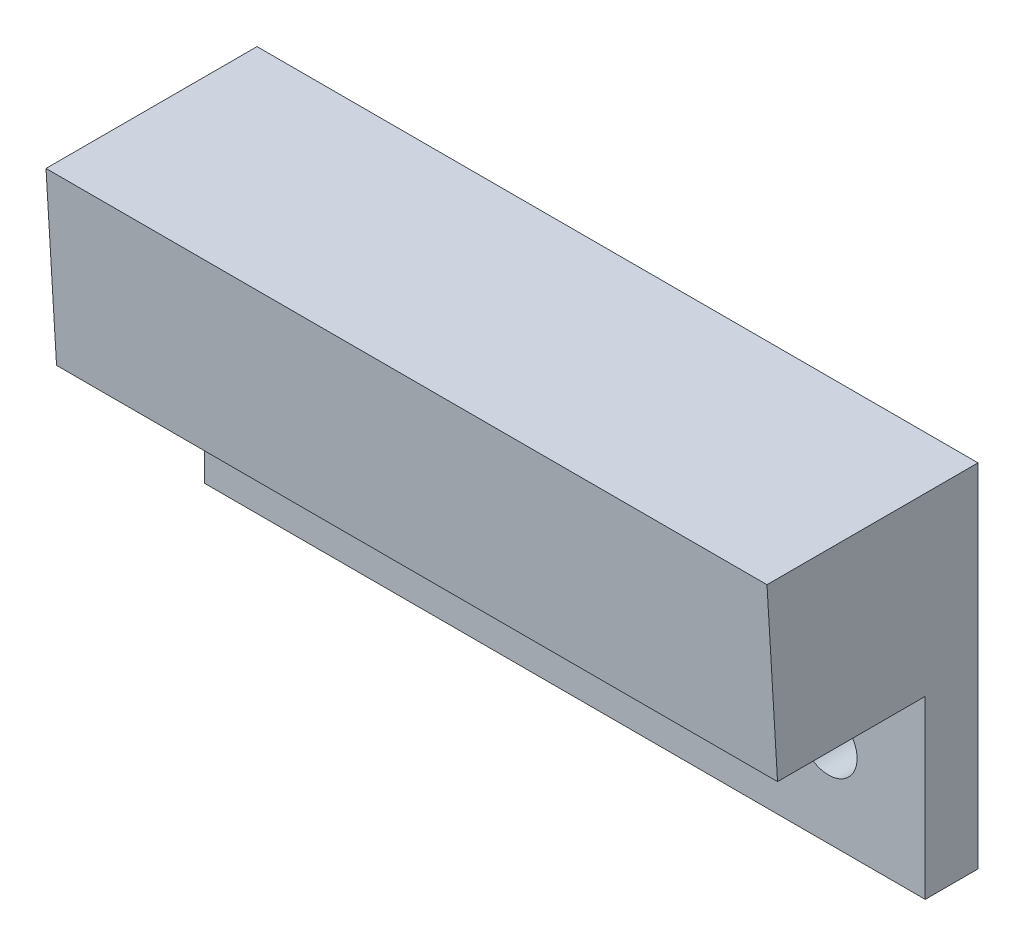
ISO-10303-21;
HEADER;
FILE_DESCRIPTION(('STEP AP214'),'2;1');
FILE_NAME('part.step','',(''),(''),'','','');
FILE_SCHEMA(('AUTOMOTIVE_DESIGN { 1 0 10303 214 1 1 1 1 }'));
ENDSEC;
DATA;
#1=APPLICATION_CONTEXT('core data for automotive mechanical design processes');
#2=APPLICATION_PROTOCOL_DEFINITION('international standard','automotive_design',2000,#1);
#3=PRODUCT_CONTEXT('',#1,'mechanical');
#4=PRODUCT('Part','Part','',(#3));
#5=PRODUCT_RELATED_PRODUCT_CATEGORY('part','',(#4));
#6=PRODUCT_DEFINITION_FORMATION('','',#4);
#7=PRODUCT_DEFINITION_CONTEXT('part definition',#1,'design');
#8=PRODUCT_DEFINITION('design','',#6,#7);
#9=PRODUCT_DEFINITION_SHAPE('','',#8);
#10=(LENGTH_UNIT() NAMED_UNIT(*) SI_UNIT(.MILLI.,.METRE.));
#11=(NAMED_UNIT(*) PLANE_ANGLE_UNIT() SI_UNIT($,.RADIAN.));
#12=(NAMED_UNIT(*) SI_UNIT($,.STERADIAN.) SOLID_ANGLE_UNIT());
#13=UNCERTAINTY_MEASURE_WITH_UNIT(LENGTH_MEASURE(1.E-05),#10,'distance_accuracy_value','');
#14=(GEOMETRIC_REPRESENTATION_CONTEXT(3) GLOBAL_UNCERTAINTY_ASSIGNED_CONTEXT((#13)) GLOBAL_UNIT_ASSIGNED_CONTEXT((#10,
#11,#12)) REPRESENTATION_CONTEXT('',''));
#15=CARTESIAN_POINT('',(0.,0.,0.));
#16=DIRECTION('',(0.,0.,1.));
#17=DIRECTION('',(1.,0.,0.));
#18=AXIS2_PLACEMENT_3D('',#15,#16,#17);
#19=CARTESIAN_POINT('',(0.,-10.,12.));
#20=DIRECTION('',(0.,1.,0.));
#21=DIRECTION('',(0.,0.,1.));
#22=AXIS2_PLACEMENT_3D('',#19,#20,#21);
#23=PLANE('',#22);
#24=DIRECTION('',(0.,0.,-1.));
#25=VECTOR('',#24,1.);
#26=CARTESIAN_POINT('',(41.,-10.,12.));
#27=LINE('',#26,#25);
#28=CARTESIAN_POINT('',(41.,-10.,11.4));
#29=VERTEX_POINT('',#28);
#30=CARTESIAN_POINT('',(41.,-10.,3.));
#31=VERTEX_POINT('',#30);
#32=EDGE_CURVE('E41',#29,#31,#27,.T.);
#33=ORIENTED_EDGE('',*,*,#32,.F.);
#34=DIRECTION('',(1.,0.,0.));
#35=VECTOR('',#34,1.);
#36=CARTESIAN_POINT('',(0.,-10.,11.4));
#37=LINE('',#36,#35);
#38=CARTESIAN_POINT('',(0.,-10.,11.4));
#39=VERTEX_POINT('',#38);
#40=EDGE_CURVE('E94',#39,#29,#37,.T.);
#41=ORIENTED_EDGE('',*,*,#40,.F.);
#42=DIRECTION('',(0.,0.,-1.));
#43=VECTOR('',#42,1.);
#44=CARTESIAN_POINT('',(0.,-10.,12.));
#45=LINE('',#44,#43);
#46=CARTESIAN_POINT('',(0.,-10.,3.));
#47=VERTEX_POINT('',#46);
#48=EDGE_CURVE('E11',#39,#47,#45,.T.);
#49=ORIENTED_EDGE('',*,*,#48,.T.);
#50=DIRECTION('',(-1.,0.,0.));
#51=VECTOR('',#50,1.);
#52=CARTESIAN_POINT('',(0.,-10.,3.));
#53=LINE('',#52,#51);
#54=EDGE_CURVE('E119',#31,#47,#53,.T.);
#55=ORIENTED_EDGE('',*,*,#54,.F.);
#56=EDGE_LOOP('',(#33,#41,#49,#55));
#57=FACE_BOUND('',#56,.T.);
#58=ADVANCED_FACE('F33',(#57),#23,.F.);
#59=CARTESIAN_POINT('',(0.,0.,12.));
#60=DIRECTION('',(1.,0.,0.));
#61=DIRECTION('',(0.,1.,0.));
#62=AXIS2_PLACEMENT_3D('',#59,#60,#61);
#63=PLANE('',#62);
#64=ORIENTED_EDGE('',*,*,#48,.F.);
#65=DIRECTION('',(0.,0.998204845465778,0.0598922907279467));
#66=VECTOR('',#65,1.);
#67=CARTESIAN_POINT('',(0.,0.,12.));
#68=LINE('',#67,#66);
#69=CARTESIAN_POINT('',(0.,0.,12.));
#70=VERTEX_POINT('',#69);
#71=EDGE_CURVE('E91',#39,#70,#68,.T.);
#72=ORIENTED_EDGE('',*,*,#71,.T.);
#73=DIRECTION('',(0.,0.,-1.));
#74=VECTOR('',#73,1.);
#75=CARTESIAN_POINT('',(0.,0.,12.));
#76=LINE('',#75,#74);
#77=CARTESIAN_POINT('',(0.,0.,0.));
#78=VERTEX_POINT('',#77);
#79=EDGE_CURVE('E122',#70,#78,#76,.T.);
#80=ORIENTED_EDGE('',*,*,#79,.T.);
#81=DIRECTION('',(0.,-1.,0.));
#82=VECTOR('',#81,1.);
#83=CARTESIAN_POINT('',(0.,0.,0.));
#84=LINE('',#83,#82);
#85=CARTESIAN_POINT('',(0.,-20.,0.));
#86=VERTEX_POINT('',#85);
#87=EDGE_CURVE('E114',#78,#86,#84,.T.);
#88=ORIENTED_EDGE('',*,*,#87,.T.);
#89=DIRECTION('',(0.,0.,-1.));
#90=VECTOR('',#89,1.);
#91=CARTESIAN_POINT('',(0.,-20.,0.));
#92=LINE('',#91,#90);
#93=CARTESIAN_POINT('',(0.,-20.,3.));
#94=VERTEX_POINT('',#93);
#95=EDGE_CURVE('E109',#94,#86,#92,.T.);
#96=ORIENTED_EDGE('',*,*,#95,.F.);
#97=DIRECTION('',(0.,1.,0.));
#98=VECTOR('',#97,1.);
#99=CARTESIAN_POINT('',(0.,-20.,3.));
#100=LINE('',#99,#98);
#101=EDGE_CURVE('E108',#94,#47,#100,.T.);
#102=ORIENTED_EDGE('',*,*,#101,.T.);
#103=EDGE_LOOP('',(#64,#72,#80,#88,#96,#102));
#104=FACE_BOUND('',#103,.T.);
#105=ADVANCED_FACE('F35',(#104),#63,.F.);
#106=CARTESIAN_POINT('',(41.,0.,12.));
#107=DIRECTION('',(-1.,0.,0.));
#108=DIRECTION('',(0.,0.,1.));
#109=AXIS2_PLACEMENT_3D('',#106,#107,#108);
#110=PLANE('',#109);
#111=DIRECTION('',(0.,0.,-1.));
#112=VECTOR('',#111,1.);
#113=CARTESIAN_POINT('',(41.,0.,12.));
#114=LINE('',#113,#112);
#115=CARTESIAN_POINT('',(41.,0.,12.));
#116=VERTEX_POINT('',#115);
#117=CARTESIAN_POINT('',(41.,0.,0.));
#118=VERTEX_POINT('',#117);
#119=EDGE_CURVE('E128',#116,#118,#114,.T.);
#120=ORIENTED_EDGE('',*,*,#119,.F.);
#121=DIRECTION('',(0.,0.998204845465778,0.0598922907279467));
#122=VECTOR('',#121,1.);
#123=CARTESIAN_POINT('',(41.,0.,12.));
#124=LINE('',#123,#122);
#125=EDGE_CURVE('E55',#29,#116,#124,.T.);
#126=ORIENTED_EDGE('',*,*,#125,.F.);
#127=ORIENTED_EDGE('',*,*,#32,.T.);
#128=DIRECTION('',(0.,1.,0.));
#129=VECTOR('',#128,1.);
#130=CARTESIAN_POINT('',(41.,-20.,3.));
#131=LINE('',#130,#129);
#132=CARTESIAN_POINT('',(41.,-20.,3.));
#133=VERTEX_POINT('',#132);
#134=EDGE_CURVE('E111',#133,#31,#131,.T.);
#135=ORIENTED_EDGE('',*,*,#134,.F.);
#136=DIRECTION('',(0.,0.,1.));
#137=VECTOR('',#136,1.);
#138=CARTESIAN_POINT('',(41.,-20.,0.));
#139=LINE('',#138,#137);
#140=CARTESIAN_POINT('',(41.,-20.,0.));
#141=VERTEX_POINT('',#140);
#142=EDGE_CURVE('E116',#141,#133,#139,.T.);
#143=ORIENTED_EDGE('',*,*,#142,.F.);
#144=DIRECTION('',(0.,1.,0.));
#145=VECTOR('',#144,1.);
#146=CARTESIAN_POINT('',(41.,0.,0.));
#147=LINE('',#146,#145);
#148=EDGE_CURVE('E67',#141,#118,#147,.T.);
#149=ORIENTED_EDGE('',*,*,#148,.T.);
#150=EDGE_LOOP('',(#120,#126,#127,#135,#143,#149));
#151=FACE_BOUND('',#150,.T.);
#152=ADVANCED_FACE('F145',(#151),#110,.F.);
#153=CARTESIAN_POINT('',(0.,0.,12.));
#154=DIRECTION('',(0.,-1.,0.));
#155=DIRECTION('',(0.,0.,-1.));
#156=AXIS2_PLACEMENT_3D('',#153,#154,#155);
#157=PLANE('',#156);
#158=DIRECTION('',(-1.,0.,0.));
#159=VECTOR('',#158,1.);
#160=CARTESIAN_POINT('',(0.,0.,0.));
#161=LINE('',#160,#159);
#162=EDGE_CURVE('E123',#118,#78,#161,.T.);
#163=ORIENTED_EDGE('',*,*,#162,.T.);
#164=ORIENTED_EDGE('',*,*,#79,.F.);
#165=DIRECTION('',(-1.,0.,0.));
#166=VECTOR('',#165,1.);
#167=CARTESIAN_POINT('',(0.,0.,12.));
#168=LINE('',#167,#166);
#169=EDGE_CURVE('E96',#116,#70,#168,.T.);
#170=ORIENTED_EDGE('',*,*,#169,.F.);
#171=ORIENTED_EDGE('',*,*,#119,.T.);
#172=EDGE_LOOP('',(#163,#164,#170,#171));
#173=FACE_BOUND('',#172,.T.);
#174=ADVANCED_FACE('F131',(#173),#157,.F.);
#175=CARTESIAN_POINT('',(0.,0.,0.));
#176=DIRECTION('',(0.,0.,1.));
#177=DIRECTION('',(1.,0.,0.));
#178=AXIS2_PLACEMENT_3D('',#175,#176,#177);
#179=PLANE('',#178);
#180=CARTESIAN_POINT('',(5.5,-15.,0.));
#181=DIRECTION('',(0.,0.,1.));
#182=DIRECTION('',(1.,0.,0.));
#183=AXIS2_PLACEMENT_3D('',#180,#181,#182);
#184=CIRCLE('',#183,1.625);
#185=CARTESIAN_POINT('',(7.125,-15.,0.));
#186=VERTEX_POINT('',#185);
#187=EDGE_CURVE('E141',#186,#186,#184,.T.);
#188=ORIENTED_EDGE('',*,*,#187,.T.);
#189=EDGE_LOOP('',(#188));
#190=FACE_BOUND('',#189,.T.);
#191=CARTESIAN_POINT('',(35.5,-15.,0.));
#192=DIRECTION('',(0.,0.,1.));
#193=DIRECTION('',(1.,0.,0.));
#194=AXIS2_PLACEMENT_3D('',#191,#192,#193);
#195=CIRCLE('',#194,1.625);
#196=CARTESIAN_POINT('',(37.125,-15.,0.));
#197=VERTEX_POINT('',#196);
#198=EDGE_CURVE('E244',#197,#197,#195,.T.);
#199=ORIENTED_EDGE('',*,*,#198,.T.);
#200=EDGE_LOOP('',(#199));
#201=FACE_BOUND('',#200,.T.);
#202=ORIENTED_EDGE('',*,*,#87,.F.);
#203=ORIENTED_EDGE('',*,*,#162,.F.);
#204=ORIENTED_EDGE('',*,*,#148,.F.);
#205=DIRECTION('',(1.,0.,0.));
#206=VECTOR('',#205,1.);
#207=CARTESIAN_POINT('',(0.,-20.,0.));
#208=LINE('',#207,#206);
#209=EDGE_CURVE('E137',#86,#141,#208,.T.);
#210=ORIENTED_EDGE('',*,*,#209,.F.);
#211=EDGE_LOOP('',(#202,#203,#204,#210));
#212=FACE_BOUND('',#211,.T.);
#213=ADVANCED_FACE('F134',(#190,#201,#212),#179,.F.);
#214=CARTESIAN_POINT('',(0.,-20.,3.));
#215=DIRECTION('',(0.,0.,-1.));
#216=DIRECTION('',(-1.,0.,0.));
#217=AXIS2_PLACEMENT_3D('',#214,#215,#216);
#218=PLANE('',#217);
#219=CARTESIAN_POINT('',(5.5,-15.,3.));
#220=DIRECTION('',(0.,0.,1.));
#221=DIRECTION('',(1.,0.,0.));
#222=AXIS2_PLACEMENT_3D('',#219,#220,#221);
#223=CIRCLE('',#222,1.625);
#224=CARTESIAN_POINT('',(7.125,-15.,3.));
#225=VERTEX_POINT('',#224);
#226=EDGE_CURVE('E241',#225,#225,#223,.T.);
#227=ORIENTED_EDGE('',*,*,#226,.F.);
#228=EDGE_LOOP('',(#227));
#229=FACE_BOUND('',#228,.T.);
#230=CARTESIAN_POINT('',(35.5,-15.,3.));
#231=DIRECTION('',(0.,0.,1.));
#232=DIRECTION('',(1.,0.,0.));
#233=AXIS2_PLACEMENT_3D('',#230,#231,#232);
#234=CIRCLE('',#233,1.625);
#235=CARTESIAN_POINT('',(37.125,-15.,3.));
#236=VERTEX_POINT('',#235);
#237=EDGE_CURVE('E104',#236,#236,#234,.T.);
#238=ORIENTED_EDGE('',*,*,#237,.F.);
#239=EDGE_LOOP('',(#238));
#240=FACE_BOUND('',#239,.T.);
#241=ORIENTED_EDGE('',*,*,#54,.T.);
#242=ORIENTED_EDGE('',*,*,#101,.F.);
#243=DIRECTION('',(-1.,0.,0.));
#244=VECTOR('',#243,1.);
#245=CARTESIAN_POINT('',(0.,-20.,3.));
#246=LINE('',#245,#244);
#247=EDGE_CURVE('E75',#133,#94,#246,.T.);
#248=ORIENTED_EDGE('',*,*,#247,.F.);
#249=ORIENTED_EDGE('',*,*,#134,.T.);
#250=EDGE_LOOP('',(#241,#242,#248,#249));
#251=FACE_BOUND('',#250,.T.);
#252=ADVANCED_FACE('F146',(#229,#240,#251),#218,.F.);
#253=CARTESIAN_POINT('',(0.,-20.,0.));
#254=DIRECTION('',(0.,1.,0.));
#255=DIRECTION('',(0.,0.,1.));
#256=AXIS2_PLACEMENT_3D('',#253,#254,#255);
#257=PLANE('',#256);
#258=ORIENTED_EDGE('',*,*,#95,.T.);
#259=ORIENTED_EDGE('',*,*,#209,.T.);
#260=ORIENTED_EDGE('',*,*,#142,.T.);
#261=ORIENTED_EDGE('',*,*,#247,.T.);
#262=EDGE_LOOP('',(#258,#259,#260,#261));
#263=FACE_BOUND('',#262,.T.);
#264=ADVANCED_FACE('F139',(#263),#257,.F.);
#265=CARTESIAN_POINT('',(35.5,-15.,-7.));
#266=DIRECTION('',(0.,0.,1.));
#267=DIRECTION('',(1.,0.,0.));
#268=AXIS2_PLACEMENT_3D('',#265,#266,#267);
#269=CYLINDRICAL_SURFACE('',#268,1.625);
#270=ORIENTED_EDGE('',*,*,#237,.T.);
#271=EDGE_LOOP('',(#270));
#272=FACE_BOUND('',#271,.T.);
#273=ORIENTED_EDGE('',*,*,#198,.F.);
#274=EDGE_LOOP('',(#273));
#275=FACE_BOUND('',#274,.T.);
#276=ADVANCED_FACE('F154',(#272,#275),#269,.F.);
#277=CARTESIAN_POINT('',(5.5,-15.,-7.));
#278=DIRECTION('',(0.,0.,1.));
#279=DIRECTION('',(1.,0.,0.));
#280=AXIS2_PLACEMENT_3D('',#277,#278,#279);
#281=CYLINDRICAL_SURFACE('',#280,1.625);
#282=ORIENTED_EDGE('',*,*,#226,.T.);
#283=EDGE_LOOP('',(#282));
#284=FACE_BOUND('',#283,.T.);
#285=ORIENTED_EDGE('',*,*,#187,.F.);
#286=EDGE_LOOP('',(#285));
#287=FACE_BOUND('',#286,.T.);
#288=ADVANCED_FACE('F195',(#284,#287),#281,.F.);
#289=CARTESIAN_POINT('',(0.,0.,12.));
#290=DIRECTION('',(0.,0.0598922907279467,-0.998204845465779));
#291=DIRECTION('',(0.,0.998204845465779,0.0598922907279467));
#292=AXIS2_PLACEMENT_3D('',#289,#290,#291);
#293=PLANE('',#292);
#294=ORIENTED_EDGE('',*,*,#125,.T.);
#295=ORIENTED_EDGE('',*,*,#169,.T.);
#296=ORIENTED_EDGE('',*,*,#71,.F.);
#297=ORIENTED_EDGE('',*,*,#40,.T.);
#298=EDGE_LOOP('',(#294,#295,#296,#297));
#299=FACE_BOUND('',#298,.T.);
#300=ADVANCED_FACE('F93',(#299),#293,.F.);
#301=CLOSED_SHELL('',(#58,#105,#152,#174,#213,#252,#264,#276,#288,#300));
#302=MANIFOLD_SOLID_BREP('B2',#301);
#303=ADVANCED_BREP_SHAPE_REPRESENTATION('',(#18,#302),#14);
#304=SHAPE_DEFINITION_REPRESENTATION(#9,#303);
ENDSEC;
END-ISO-10303-21;
